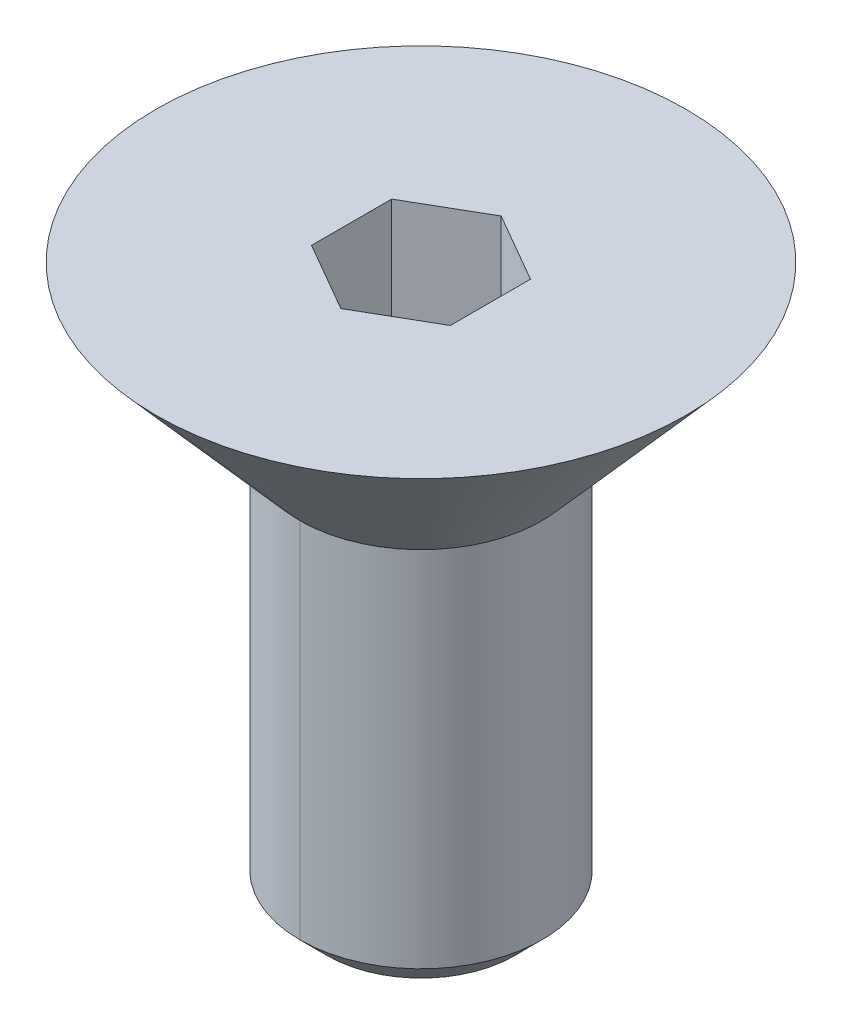
ISO-10303-21;
HEADER;
FILE_DESCRIPTION(('STEP AP214'),'2;1');
FILE_NAME('part.step','',(''),(''),'','','');
FILE_SCHEMA(('AUTOMOTIVE_DESIGN { 1 0 10303 214 1 1 1 1 }'));
ENDSEC;
DATA;
#1=APPLICATION_CONTEXT('core data for automotive mechanical design processes');
#2=APPLICATION_PROTOCOL_DEFINITION('international standard','automotive_design',2000,#1);
#3=PRODUCT_CONTEXT('',#1,'mechanical');
#4=PRODUCT('Part','Part','',(#3));
#5=PRODUCT_RELATED_PRODUCT_CATEGORY('part','',(#4));
#6=PRODUCT_DEFINITION_FORMATION('','',#4);
#7=PRODUCT_DEFINITION_CONTEXT('part definition',#1,'design');
#8=PRODUCT_DEFINITION('design','',#6,#7);
#9=PRODUCT_DEFINITION_SHAPE('','',#8);
#10=(LENGTH_UNIT() NAMED_UNIT(*) SI_UNIT(.MILLI.,.METRE.));
#11=(NAMED_UNIT(*) PLANE_ANGLE_UNIT() SI_UNIT($,.RADIAN.));
#12=(NAMED_UNIT(*) SI_UNIT($,.STERADIAN.) SOLID_ANGLE_UNIT());
#13=UNCERTAINTY_MEASURE_WITH_UNIT(LENGTH_MEASURE(1.E-05),#10,'distance_accuracy_value','');
#14=(GEOMETRIC_REPRESENTATION_CONTEXT(3) GLOBAL_UNCERTAINTY_ASSIGNED_CONTEXT((#13)) GLOBAL_UNIT_ASSIGNED_CONTEXT((#10,
#11,#12)) REPRESENTATION_CONTEXT('',''));
#15=CARTESIAN_POINT('',(0.,0.,0.));
#16=DIRECTION('',(0.,0.,1.));
#17=DIRECTION('',(1.,0.,0.));
#18=AXIS2_PLACEMENT_3D('',#15,#16,#17);
#19=CARTESIAN_POINT('',(0.,2.80903785543101,0.));
#20=DIRECTION('',(0.,-1.,0.));
#21=DIRECTION('',(0.,0.,-1.));
#22=AXIS2_PLACEMENT_3D('',#19,#20,#21);
#23=PLANE('',#22);
#24=CARTESIAN_POINT('',(0.,2.80903785543101,0.));
#25=DIRECTION('',(0.,-1.,0.));
#26=DIRECTION('',(0.,0.,-1.));
#27=AXIS2_PLACEMENT_3D('',#24,#25,#26);
#28=CIRCLE('',#27,4.5593);
#29=CARTESIAN_POINT('',(0.,2.80903785543101,-4.5593));
#30=VERTEX_POINT('',#29);
#31=CARTESIAN_POINT('',(0.,2.80903785543101,4.5593));
#32=VERTEX_POINT('',#31);
#33=EDGE_CURVE('E11',#30,#32,#28,.T.);
#34=ORIENTED_EDGE('',*,*,#33,.F.);
#35=CARTESIAN_POINT('',(0.,2.80903785543101,0.));
#36=DIRECTION('',(0.,-1.,0.));
#37=DIRECTION('',(0.,0.,-1.));
#38=AXIS2_PLACEMENT_3D('',#35,#36,#37);
#39=CIRCLE('',#38,4.5593);
#40=EDGE_CURVE('E25',#32,#30,#39,.T.);
#41=ORIENTED_EDGE('',*,*,#40,.F.);
#42=EDGE_LOOP('',(#34,#41));
#43=FACE_BOUND('',#42,.T.);
#44=DIRECTION('',(0.866025403784425,0.,-0.500000000000024));
#45=VECTOR('',#44,1.);
#46=CARTESIAN_POINT('',(0.,2.80903785543101,1.3784815027172));
#47=LINE('',#46,#45);
#48=CARTESIAN_POINT('',(0.,2.80903785543101,1.3784815027172));
#49=VERTEX_POINT('',#48);
#50=CARTESIAN_POINT('',(1.1938,2.80903785543101,0.68924075135858));
#51=VERTEX_POINT('',#50);
#52=EDGE_CURVE('E232',#49,#51,#47,.T.);
#53=ORIENTED_EDGE('',*,*,#52,.F.);
#54=DIRECTION('',(0.866025403784425,0.,0.500000000000024));
#55=VECTOR('',#54,1.);
#56=CARTESIAN_POINT('',(-1.1938,2.80903785543101,0.68924075135858));
#57=LINE('',#56,#55);
#58=CARTESIAN_POINT('',(-1.1938,2.80903785543101,0.68924075135858));
#59=VERTEX_POINT('',#58);
#60=EDGE_CURVE('E227',#59,#49,#57,.T.);
#61=ORIENTED_EDGE('',*,*,#60,.F.);
#62=DIRECTION('',(0.,0.,1.));
#63=VECTOR('',#62,1.);
#64=CARTESIAN_POINT('',(-1.1938,2.80903785543101,-0.68924075135858));
#65=LINE('',#64,#63);
#66=CARTESIAN_POINT('',(-1.1938,2.80903785543101,-0.68924075135858));
#67=VERTEX_POINT('',#66);
#68=EDGE_CURVE('E222',#67,#59,#65,.T.);
#69=ORIENTED_EDGE('',*,*,#68,.F.);
#70=DIRECTION('',(-0.866025403784425,0.,0.500000000000024));
#71=VECTOR('',#70,1.);
#72=CARTESIAN_POINT('',(0.,2.80903785543101,-1.3784815027172));
#73=LINE('',#72,#71);
#74=CARTESIAN_POINT('',(0.,2.80903785543101,-1.3784815027172));
#75=VERTEX_POINT('',#74);
#76=EDGE_CURVE('E217',#75,#67,#73,.T.);
#77=ORIENTED_EDGE('',*,*,#76,.F.);
#78=DIRECTION('',(-0.866025403784425,0.,-0.500000000000024));
#79=VECTOR('',#78,1.);
#80=CARTESIAN_POINT('',(1.1938,2.80903785543101,-0.68924075135858));
#81=LINE('',#80,#79);
#82=CARTESIAN_POINT('',(1.1938,2.80903785543101,-0.68924075135858));
#83=VERTEX_POINT('',#82);
#84=EDGE_CURVE('E212',#83,#75,#81,.T.);
#85=ORIENTED_EDGE('',*,*,#84,.F.);
#86=DIRECTION('',(0.,0.,1.));
#87=VECTOR('',#86,1.);
#88=CARTESIAN_POINT('',(1.1938,2.80903785543101,0.));
#89=LINE('',#88,#87);
#90=EDGE_CURVE('E208',#83,#51,#89,.T.);
#91=ORIENTED_EDGE('',*,*,#90,.T.);
#92=EDGE_LOOP('',(#53,#61,#69,#77,#85,#91));
#93=FACE_BOUND('',#92,.T.);
#94=ADVANCED_FACE('F17',(#43,#93),#23,.F.);
#95=CARTESIAN_POINT('',(1.1938,0.421437855431001,0.68924075135858));
#96=DIRECTION('',(1.,0.,0.));
#97=DIRECTION('',(0.,0.,-1.));
#98=AXIS2_PLACEMENT_3D('',#95,#96,#97);
#99=PLANE('',#98);
#100=DIRECTION('',(0.,1.,0.));
#101=VECTOR('',#100,1.);
#102=CARTESIAN_POINT('',(1.1938,0.421437855431001,0.68924075135858));
#103=LINE('',#102,#101);
#104=CARTESIAN_POINT('',(1.1938,0.421437855431001,0.68924075135858));
#105=VERTEX_POINT('',#104);
#106=EDGE_CURVE('E203',#105,#51,#103,.T.);
#107=ORIENTED_EDGE('',*,*,#106,.T.);
#108=ORIENTED_EDGE('',*,*,#90,.F.);
#109=DIRECTION('',(0.,1.,0.));
#110=VECTOR('',#109,1.);
#111=CARTESIAN_POINT('',(1.1938,0.421437855431001,-0.68924075135858));
#112=LINE('',#111,#110);
#113=CARTESIAN_POINT('',(1.1938,0.421437855431001,-0.68924075135858));
#114=VERTEX_POINT('',#113);
#115=EDGE_CURVE('E198',#114,#83,#112,.T.);
#116=ORIENTED_EDGE('',*,*,#115,.F.);
#117=DIRECTION('',(0.,0.,-1.));
#118=VECTOR('',#117,1.);
#119=CARTESIAN_POINT('',(1.1938,0.421437855431001,0.68924075135858));
#120=LINE('',#119,#118);
#121=EDGE_CURVE('E193',#105,#114,#120,.T.);
#122=ORIENTED_EDGE('',*,*,#121,.F.);
#123=EDGE_LOOP('',(#107,#108,#116,#122));
#124=FACE_BOUND('',#123,.T.);
#125=ADVANCED_FACE('F263',(#124),#99,.F.);
#126=CARTESIAN_POINT('',(0.,0.421437855431001,0.));
#127=DIRECTION('',(0.,1.,0.));
#128=DIRECTION('',(0.,0.,1.));
#129=AXIS2_PLACEMENT_3D('',#126,#127,#128);
#130=PLANE('',#129);
#131=DIRECTION('',(0.,0.,1.));
#132=VECTOR('',#131,1.);
#133=CARTESIAN_POINT('',(-1.1938,0.421437855431001,-0.68924075135858));
#134=LINE('',#133,#132);
#135=CARTESIAN_POINT('',(-1.1938,0.421437855431001,-0.68924075135858));
#136=VERTEX_POINT('',#135);
#137=CARTESIAN_POINT('',(-1.1938,0.421437855431001,0.68924075135858));
#138=VERTEX_POINT('',#137);
#139=EDGE_CURVE('E189',#136,#138,#134,.T.);
#140=ORIENTED_EDGE('',*,*,#139,.T.);
#141=DIRECTION('',(0.866025403784425,0.,0.500000000000024));
#142=VECTOR('',#141,1.);
#143=CARTESIAN_POINT('',(-1.1938,0.421437855431001,0.68924075135858));
#144=LINE('',#143,#142);
#145=CARTESIAN_POINT('',(0.,0.421437855431001,1.3784815027172));
#146=VERTEX_POINT('',#145);
#147=EDGE_CURVE('E185',#138,#146,#144,.T.);
#148=ORIENTED_EDGE('',*,*,#147,.T.);
#149=DIRECTION('',(0.866025403784425,0.,-0.500000000000024));
#150=VECTOR('',#149,1.);
#151=CARTESIAN_POINT('',(0.,0.421437855431001,1.3784815027172));
#152=LINE('',#151,#150);
#153=EDGE_CURVE('E180',#146,#105,#152,.T.);
#154=ORIENTED_EDGE('',*,*,#153,.T.);
#155=ORIENTED_EDGE('',*,*,#121,.T.);
#156=DIRECTION('',(-0.866025403784425,0.,-0.500000000000024));
#157=VECTOR('',#156,1.);
#158=CARTESIAN_POINT('',(1.1938,0.421437855431001,-0.68924075135858));
#159=LINE('',#158,#157);
#160=CARTESIAN_POINT('',(0.,0.421437855431001,-1.3784815027172));
#161=VERTEX_POINT('',#160);
#162=EDGE_CURVE('E176',#114,#161,#159,.T.);
#163=ORIENTED_EDGE('',*,*,#162,.T.);
#164=DIRECTION('',(-0.866025403784425,0.,0.500000000000024));
#165=VECTOR('',#164,1.);
#166=CARTESIAN_POINT('',(0.,0.421437855431001,-1.3784815027172));
#167=LINE('',#166,#165);
#168=EDGE_CURVE('E172',#161,#136,#167,.T.);
#169=ORIENTED_EDGE('',*,*,#168,.T.);
#170=EDGE_LOOP('',(#140,#148,#154,#155,#163,#169));
#171=FACE_BOUND('',#170,.T.);
#172=ADVANCED_FACE('F267',(#171),#130,.T.);
#173=CARTESIAN_POINT('',(0.,0.421437855431001,-1.3784815027172));
#174=DIRECTION('',(-0.500000000000024,0.,-0.866025403784425));
#175=DIRECTION('',(-0.866025403784425,0.,0.500000000000024));
#176=AXIS2_PLACEMENT_3D('',#173,#174,#175);
#177=PLANE('',#176);
#178=ORIENTED_EDGE('',*,*,#76,.T.);
#179=DIRECTION('',(0.,1.,0.));
#180=VECTOR('',#179,1.);
#181=CARTESIAN_POINT('',(-1.1938,0.421437855431001,-0.68924075135858));
#182=LINE('',#181,#180);
#183=EDGE_CURVE('E167',#136,#67,#182,.T.);
#184=ORIENTED_EDGE('',*,*,#183,.F.);
#185=ORIENTED_EDGE('',*,*,#168,.F.);
#186=DIRECTION('',(0.,1.,0.));
#187=VECTOR('',#186,1.);
#188=CARTESIAN_POINT('',(0.,0.421437855431001,-1.3784815027172));
#189=LINE('',#188,#187);
#190=EDGE_CURVE('E162',#161,#75,#189,.T.);
#191=ORIENTED_EDGE('',*,*,#190,.T.);
#192=EDGE_LOOP('',(#178,#184,#185,#191));
#193=FACE_BOUND('',#192,.T.);
#194=ADVANCED_FACE('F288',(#193),#177,.F.);
#195=CARTESIAN_POINT('',(1.1938,0.421437855431001,-0.68924075135858));
#196=DIRECTION('',(0.500000000000024,0.,-0.866025403784425));
#197=DIRECTION('',(-0.866025403784425,0.,-0.500000000000024));
#198=AXIS2_PLACEMENT_3D('',#195,#196,#197);
#199=PLANE('',#198);
#200=ORIENTED_EDGE('',*,*,#84,.T.);
#201=ORIENTED_EDGE('',*,*,#190,.F.);
#202=ORIENTED_EDGE('',*,*,#162,.F.);
#203=ORIENTED_EDGE('',*,*,#115,.T.);
#204=EDGE_LOOP('',(#200,#201,#202,#203));
#205=FACE_BOUND('',#204,.T.);
#206=ADVANCED_FACE('F291',(#205),#199,.F.);
#207=CARTESIAN_POINT('',(-1.1938,0.421437855431001,-0.68924075135858));
#208=DIRECTION('',(-1.,0.,0.));
#209=DIRECTION('',(0.,0.,1.));
#210=AXIS2_PLACEMENT_3D('',#207,#208,#209);
#211=PLANE('',#210);
#212=ORIENTED_EDGE('',*,*,#68,.T.);
#213=DIRECTION('',(0.,1.,0.));
#214=VECTOR('',#213,1.);
#215=CARTESIAN_POINT('',(-1.1938,0.421437855431001,0.68924075135858));
#216=LINE('',#215,#214);
#217=EDGE_CURVE('E157',#138,#59,#216,.T.);
#218=ORIENTED_EDGE('',*,*,#217,.F.);
#219=ORIENTED_EDGE('',*,*,#139,.F.);
#220=ORIENTED_EDGE('',*,*,#183,.T.);
#221=EDGE_LOOP('',(#212,#218,#219,#220));
#222=FACE_BOUND('',#221,.T.);
#223=ADVANCED_FACE('F286',(#222),#211,.F.);
#224=CARTESIAN_POINT('',(-1.1938,0.421437855431001,0.68924075135858));
#225=DIRECTION('',(-0.500000000000024,0.,0.866025403784425));
#226=DIRECTION('',(0.866025403784425,0.,0.500000000000024));
#227=AXIS2_PLACEMENT_3D('',#224,#225,#226);
#228=PLANE('',#227);
#229=ORIENTED_EDGE('',*,*,#60,.T.);
#230=DIRECTION('',(0.,1.,0.));
#231=VECTOR('',#230,1.);
#232=CARTESIAN_POINT('',(0.,0.421437855431001,1.3784815027172));
#233=LINE('',#232,#231);
#234=EDGE_CURVE('E152',#146,#49,#233,.T.);
#235=ORIENTED_EDGE('',*,*,#234,.F.);
#236=ORIENTED_EDGE('',*,*,#147,.F.);
#237=ORIENTED_EDGE('',*,*,#217,.T.);
#238=EDGE_LOOP('',(#229,#235,#236,#237));
#239=FACE_BOUND('',#238,.T.);
#240=ADVANCED_FACE('F275',(#239),#228,.F.);
#241=CARTESIAN_POINT('',(0.,0.421437855431001,1.3784815027172));
#242=DIRECTION('',(0.500000000000024,0.,0.866025403784425));
#243=DIRECTION('',(0.866025403784425,0.,-0.500000000000024));
#244=AXIS2_PLACEMENT_3D('',#241,#242,#243);
#245=PLANE('',#244);
#246=ORIENTED_EDGE('',*,*,#52,.T.);
#247=ORIENTED_EDGE('',*,*,#106,.F.);
#248=ORIENTED_EDGE('',*,*,#153,.F.);
#249=ORIENTED_EDGE('',*,*,#234,.T.);
#250=EDGE_LOOP('',(#246,#247,#248,#249));
#251=FACE_BOUND('',#250,.T.);
#252=ADVANCED_FACE('F279',(#251),#245,.F.);
#253=CARTESIAN_POINT('',(0.,2.80903785543101,0.));
#254=DIRECTION('',(0.,1.,0.));
#255=DIRECTION('',(1.,0.,0.));
#256=AXIS2_PLACEMENT_3D('',#253,#254,#255);
#257=CONICAL_SURFACE('',#256,4.5593,0.7225663103);
#258=ORIENTED_EDGE('',*,*,#40,.T.);
#259=DIRECTION('',(0.,0.750111069647424,-0.66131186530441));
#260=VECTOR('',#259,1.);
#261=CARTESIAN_POINT('',(0.,-6.3528293736681E-11,-2.08280000007206));
#262=LINE('',#261,#260);
#263=CARTESIAN_POINT('',(0.,0.,-2.0828));
#264=VERTEX_POINT('',#263);
#265=EDGE_CURVE('E147',#264,#30,#262,.T.);
#266=ORIENTED_EDGE('',*,*,#265,.F.);
#267=CARTESIAN_POINT('',(0.,0.,0.));
#268=DIRECTION('',(0.,-1.,0.));
#269=DIRECTION('',(0.,0.,-1.));
#270=AXIS2_PLACEMENT_3D('',#267,#268,#269);
#271=CIRCLE('',#270,2.0828);
#272=CARTESIAN_POINT('',(0.,0.,2.0828));
#273=VERTEX_POINT('',#272);
#274=EDGE_CURVE('E142',#273,#264,#271,.T.);
#275=ORIENTED_EDGE('',*,*,#274,.F.);
#276=DIRECTION('',(0.,0.750111069647424,0.66131186530441));
#277=VECTOR('',#276,1.);
#278=CARTESIAN_POINT('',(0.,-6.3528293736681E-11,2.08280000007206));
#279=LINE('',#278,#277);
#280=EDGE_CURVE('E138',#273,#32,#279,.T.);
#281=ORIENTED_EDGE('',*,*,#280,.T.);
#282=EDGE_LOOP('',(#258,#266,#275,#281));
#283=FACE_BOUND('',#282,.T.);
#284=ADVANCED_FACE('F242',(#283),#257,.T.);
#285=CARTESIAN_POINT('',(0.,2.80903785543101,0.));
#286=DIRECTION('',(0.,1.,0.));
#287=DIRECTION('',(-1.,0.,0.));
#288=AXIS2_PLACEMENT_3D('',#285,#286,#287);
#289=CONICAL_SURFACE('',#288,4.5593,0.7225663103);
#290=CARTESIAN_POINT('',(0.,0.,0.));
#291=DIRECTION('',(0.,-1.,0.));
#292=DIRECTION('',(0.,0.,-1.));
#293=AXIS2_PLACEMENT_3D('',#290,#291,#292);
#294=CIRCLE('',#293,2.0828);
#295=EDGE_CURVE('E133',#264,#273,#294,.T.);
#296=ORIENTED_EDGE('',*,*,#295,.F.);
#297=ORIENTED_EDGE('',*,*,#265,.T.);
#298=ORIENTED_EDGE('',*,*,#33,.T.);
#299=ORIENTED_EDGE('',*,*,#280,.F.);
#300=EDGE_LOOP('',(#296,#297,#298,#299));
#301=FACE_BOUND('',#300,.T.);
#302=ADVANCED_FACE('F246',(#301),#289,.T.);
#303=CARTESIAN_POINT('',(0.,-6.71596214456899,0.));
#304=DIRECTION('',(0.,1.,0.));
#305=DIRECTION('',(-1.,0.,0.));
#306=AXIS2_PLACEMENT_3D('',#303,#304,#305);
#307=CYLINDRICAL_SURFACE('',#306,2.0828);
#308=CARTESIAN_POINT('',(0.,-6.24352214456899,0.));
#309=DIRECTION('',(0.,-1.,0.));
#310=DIRECTION('',(0.,0.,-1.));
#311=AXIS2_PLACEMENT_3D('',#308,#309,#310);
#312=CIRCLE('',#311,2.0828);
#313=CARTESIAN_POINT('',(0.,-6.24352214456899,-2.0828));
#314=VERTEX_POINT('',#313);
#315=CARTESIAN_POINT('',(0.,-6.24352214456899,2.0828));
#316=VERTEX_POINT('',#315);
#317=EDGE_CURVE('E104',#314,#316,#312,.T.);
#318=ORIENTED_EDGE('',*,*,#317,.F.);
#319=DIRECTION('',(0.,1.,0.));
#320=VECTOR('',#319,1.);
#321=CARTESIAN_POINT('',(0.,-6.24352214456899,-2.0828));
#322=LINE('',#321,#320);
#323=EDGE_CURVE('E125',#314,#264,#322,.T.);
#324=ORIENTED_EDGE('',*,*,#323,.T.);
#325=ORIENTED_EDGE('',*,*,#295,.T.);
#326=DIRECTION('',(0.,1.,0.));
#327=VECTOR('',#326,1.);
#328=CARTESIAN_POINT('',(0.,-6.24352214456899,2.0828));
#329=LINE('',#328,#327);
#330=EDGE_CURVE('E120',#316,#273,#329,.T.);
#331=ORIENTED_EDGE('',*,*,#330,.F.);
#332=EDGE_LOOP('',(#318,#324,#325,#331));
#333=FACE_BOUND('',#332,.T.);
#334=ADVANCED_FACE('F249',(#333),#307,.T.);
#335=CARTESIAN_POINT('',(0.,-6.71596214456899,0.));
#336=DIRECTION('',(0.,1.,0.));
#337=DIRECTION('',(1.,0.,0.));
#338=AXIS2_PLACEMENT_3D('',#335,#336,#337);
#339=CYLINDRICAL_SURFACE('',#338,2.0828);
#340=ORIENTED_EDGE('',*,*,#274,.T.);
#341=ORIENTED_EDGE('',*,*,#323,.F.);
#342=CARTESIAN_POINT('',(0.,-6.24352214456899,0.));
#343=DIRECTION('',(0.,-1.,0.));
#344=DIRECTION('',(0.,0.,-1.));
#345=AXIS2_PLACEMENT_3D('',#342,#343,#344);
#346=CIRCLE('',#345,2.0828);
#347=EDGE_CURVE('E116',#316,#314,#346,.T.);
#348=ORIENTED_EDGE('',*,*,#347,.F.);
#349=ORIENTED_EDGE('',*,*,#330,.T.);
#350=EDGE_LOOP('',(#340,#341,#348,#349));
#351=FACE_BOUND('',#350,.T.);
#352=ADVANCED_FACE('F252',(#351),#339,.T.);
#353=CARTESIAN_POINT('',(0.,-6.24352214456899,0.));
#354=DIRECTION('',(0.,1.,0.));
#355=DIRECTION('',(1.,0.,0.));
#356=AXIS2_PLACEMENT_3D('',#353,#354,#355);
#357=CONICAL_SURFACE('',#356,2.0828,0.7853981634);
#358=ORIENTED_EDGE('',*,*,#347,.T.);
#359=DIRECTION('',(0.,0.707106781184743,-0.707106781188352));
#360=VECTOR('',#359,1.);
#361=CARTESIAN_POINT('',(0.,-6.71596214456778,-1.61035999999879));
#362=LINE('',#361,#360);
#363=CARTESIAN_POINT('',(0.,-6.71596214456899,-1.61036));
#364=VERTEX_POINT('',#363);
#365=EDGE_CURVE('E96',#364,#314,#362,.T.);
#366=ORIENTED_EDGE('',*,*,#365,.F.);
#367=CARTESIAN_POINT('',(0.,-6.71596214456899,0.));
#368=DIRECTION('',(0.,-1.,0.));
#369=DIRECTION('',(0.,0.,-1.));
#370=AXIS2_PLACEMENT_3D('',#367,#368,#369);
#371=CIRCLE('',#370,1.61036);
#372=CARTESIAN_POINT('',(0.,-6.71596214456778,1.61035999999879));
#373=VERTEX_POINT('',#372);
#374=EDGE_CURVE('E89',#373,#364,#371,.T.);
#375=ORIENTED_EDGE('',*,*,#374,.F.);
#376=DIRECTION('',(0.,0.707106781184743,0.707106781188352));
#377=VECTOR('',#376,1.);
#378=CARTESIAN_POINT('',(0.,-6.71596214456778,1.61035999999879));
#379=LINE('',#378,#377);
#380=EDGE_CURVE('E93',#373,#316,#379,.T.);
#381=ORIENTED_EDGE('',*,*,#380,.T.);
#382=EDGE_LOOP('',(#358,#366,#375,#381));
#383=FACE_BOUND('',#382,.T.);
#384=ADVANCED_FACE('F92',(#383),#357,.T.);
#385=CARTESIAN_POINT('',(0.,-6.24352214456899,0.));
#386=DIRECTION('',(0.,1.,0.));
#387=DIRECTION('',(-1.,0.,0.));
#388=AXIS2_PLACEMENT_3D('',#385,#386,#387);
#389=CONICAL_SURFACE('',#388,2.0828,0.7853981634);
#390=CARTESIAN_POINT('',(0.,-6.71596214456899,0.));
#391=DIRECTION('',(0.,-1.,0.));
#392=DIRECTION('',(0.,0.,-1.));
#393=AXIS2_PLACEMENT_3D('',#390,#391,#392);
#394=CIRCLE('',#393,1.61036);
#395=EDGE_CURVE('E103',#364,#373,#394,.T.);
#396=ORIENTED_EDGE('',*,*,#395,.F.);
#397=ORIENTED_EDGE('',*,*,#365,.T.);
#398=ORIENTED_EDGE('',*,*,#317,.T.);
#399=ORIENTED_EDGE('',*,*,#380,.F.);
#400=EDGE_LOOP('',(#396,#397,#398,#399));
#401=FACE_BOUND('',#400,.T.);
#402=ADVANCED_FACE('F102',(#401),#389,.T.);
#403=CARTESIAN_POINT('',(1.61036,-6.71596214456899,0.));
#404=DIRECTION('',(0.,1.,0.));
#405=DIRECTION('',(0.,0.,1.));
#406=AXIS2_PLACEMENT_3D('',#403,#404,#405);
#407=PLANE('',#406);
#408=ORIENTED_EDGE('',*,*,#395,.T.);
#409=ORIENTED_EDGE('',*,*,#374,.T.);
#410=EDGE_LOOP('',(#408,#409));
#411=FACE_BOUND('',#410,.T.);
#412=ADVANCED_FACE('F106',(#411),#407,.F.);
#413=CLOSED_SHELL('',(#94,#125,#172,#194,#206,#223,#240,#252,#284,#302,#334,#352,#384,#402,#412));
#414=MANIFOLD_SOLID_BREP('B1',#413);
#415=ADVANCED_BREP_SHAPE_REPRESENTATION('',(#18,#414),#14);
#416=SHAPE_DEFINITION_REPRESENTATION(#9,#415);
ENDSEC;
END-ISO-10303-21;
